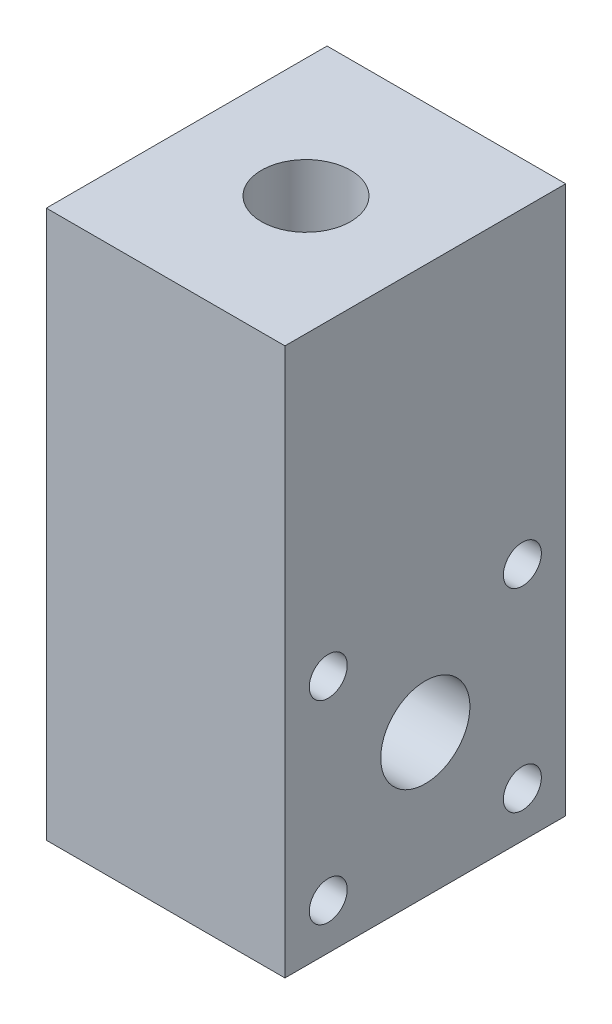
ISO-10303-21;
HEADER;
FILE_DESCRIPTION(('STEP AP214'),'2;1');
FILE_NAME('part.step','',(''),(''),'','','');
FILE_SCHEMA(('AUTOMOTIVE_DESIGN { 1 0 10303 214 1 1 1 1 }'));
ENDSEC;
DATA;
#1=APPLICATION_CONTEXT('core data for automotive mechanical design processes');
#2=APPLICATION_PROTOCOL_DEFINITION('international standard','automotive_design',2000,#1);
#3=PRODUCT_CONTEXT('',#1,'mechanical');
#4=PRODUCT('Part','Part','',(#3));
#5=PRODUCT_RELATED_PRODUCT_CATEGORY('part','',(#4));
#6=PRODUCT_DEFINITION_FORMATION('','',#4);
#7=PRODUCT_DEFINITION_CONTEXT('part definition',#1,'design');
#8=PRODUCT_DEFINITION('design','',#6,#7);
#9=PRODUCT_DEFINITION_SHAPE('','',#8);
#10=(LENGTH_UNIT() NAMED_UNIT(*) SI_UNIT(.MILLI.,.METRE.));
#11=(NAMED_UNIT(*) PLANE_ANGLE_UNIT() SI_UNIT($,.RADIAN.));
#12=(NAMED_UNIT(*) SI_UNIT($,.STERADIAN.) SOLID_ANGLE_UNIT());
#13=UNCERTAINTY_MEASURE_WITH_UNIT(LENGTH_MEASURE(1.E-05),#10,'distance_accuracy_value','');
#14=(GEOMETRIC_REPRESENTATION_CONTEXT(3) GLOBAL_UNCERTAINTY_ASSIGNED_CONTEXT((#13)) GLOBAL_UNIT_ASSIGNED_CONTEXT((#10,
#11,#12)) REPRESENTATION_CONTEXT('',''));
#15=CARTESIAN_POINT('',(0.,0.,0.));
#16=DIRECTION('',(0.,0.,1.));
#17=DIRECTION('',(1.,0.,0.));
#18=AXIS2_PLACEMENT_3D('',#15,#16,#17);
#19=CARTESIAN_POINT('',(8.5,19.5,10.));
#20=DIRECTION('',(-1.,0.,0.));
#21=DIRECTION('',(0.,0.,1.));
#22=AXIS2_PLACEMENT_3D('',#19,#20,#21);
#23=PLANE('',#22);
#24=CARTESIAN_POINT('',(8.5,-2.42520278677676,-6.91479721322324));
#25=DIRECTION('',(1.,0.,0.));
#26=DIRECTION('',(0.,0.,-1.));
#27=AXIS2_PLACEMENT_3D('',#24,#25,#26);
#28=CIRCLE('',#27,1.35254999999999);
#29=CARTESIAN_POINT('',(8.5,-2.42520278677676,-8.26734721322323));
#30=VERTEX_POINT('',#29);
#31=EDGE_CURVE('E135',#30,#30,#28,.T.);
#32=ORIENTED_EDGE('',*,*,#31,.F.);
#33=EDGE_LOOP('',(#32));
#34=FACE_BOUND('',#33,.T.);
#35=CARTESIAN_POINT('',(8.5,-16.2547972132233,6.91479721322324));
#36=DIRECTION('',(1.,0.,0.));
#37=DIRECTION('',(0.,0.,-1.));
#38=AXIS2_PLACEMENT_3D('',#35,#36,#37);
#39=CIRCLE('',#38,1.35254999999999);
#40=CARTESIAN_POINT('',(8.5,-16.2547972132233,5.56224721322325));
#41=VERTEX_POINT('',#40);
#42=EDGE_CURVE('E141',#41,#41,#39,.T.);
#43=ORIENTED_EDGE('',*,*,#42,.F.);
#44=EDGE_LOOP('',(#43));
#45=FACE_BOUND('',#44,.T.);
#46=CARTESIAN_POINT('',(8.5,-16.2547972132233,-6.91479721322319));
#47=DIRECTION('',(1.,0.,0.));
#48=DIRECTION('',(0.,0.,-1.));
#49=AXIS2_PLACEMENT_3D('',#46,#47,#48);
#50=CIRCLE('',#49,1.35254999999999);
#51=CARTESIAN_POINT('',(8.5,-16.2547972132233,-8.26734721322319));
#52=VERTEX_POINT('',#51);
#53=EDGE_CURVE('E142',#52,#52,#50,.T.);
#54=ORIENTED_EDGE('',*,*,#53,.F.);
#55=EDGE_LOOP('',(#54));
#56=FACE_BOUND('',#55,.T.);
#57=CARTESIAN_POINT('',(8.5,-2.42520278677676,6.91479721322324));
#58=DIRECTION('',(1.,0.,0.));
#59=DIRECTION('',(0.,0.,-1.));
#60=AXIS2_PLACEMENT_3D('',#57,#58,#59);
#61=CIRCLE('',#60,1.35254999999999);
#62=CARTESIAN_POINT('',(8.5,-2.42520278677676,5.56224721322324));
#63=VERTEX_POINT('',#62);
#64=EDGE_CURVE('E132',#63,#63,#61,.T.);
#65=ORIENTED_EDGE('',*,*,#64,.F.);
#66=EDGE_LOOP('',(#65));
#67=FACE_BOUND('',#66,.T.);
#68=CARTESIAN_POINT('',(8.5,-9.34,0.));
#69=DIRECTION('',(-1.,0.,0.));
#70=DIRECTION('',(0.,0.,1.));
#71=AXIS2_PLACEMENT_3D('',#68,#69,#70);
#72=CIRCLE('',#71,3.175);
#73=CARTESIAN_POINT('',(8.5,-9.34,3.175));
#74=VERTEX_POINT('',#73);
#75=EDGE_CURVE('E109',#74,#74,#72,.T.);
#76=ORIENTED_EDGE('',*,*,#75,.T.);
#77=EDGE_LOOP('',(#76));
#78=FACE_BOUND('',#77,.T.);
#79=DIRECTION('',(0.,0.,-1.));
#80=VECTOR('',#79,1.);
#81=CARTESIAN_POINT('',(8.5,-19.5,10.));
#82=LINE('',#81,#80);
#83=CARTESIAN_POINT('',(8.5,-19.5,10.));
#84=VERTEX_POINT('',#83);
#85=CARTESIAN_POINT('',(8.5,-19.5,-10.));
#86=VERTEX_POINT('',#85);
#87=EDGE_CURVE('E106',#84,#86,#82,.T.);
#88=ORIENTED_EDGE('',*,*,#87,.T.);
#89=DIRECTION('',(0.,-1.,0.));
#90=VECTOR('',#89,1.);
#91=CARTESIAN_POINT('',(8.5,19.5,-10.));
#92=LINE('',#91,#90);
#93=CARTESIAN_POINT('',(8.5,19.5,-10.));
#94=VERTEX_POINT('',#93);
#95=EDGE_CURVE('E11',#94,#86,#92,.T.);
#96=ORIENTED_EDGE('',*,*,#95,.F.);
#97=DIRECTION('',(0.,0.,-1.));
#98=VECTOR('',#97,1.);
#99=CARTESIAN_POINT('',(8.5,19.5,10.));
#100=LINE('',#99,#98);
#101=CARTESIAN_POINT('',(8.5,19.5,10.));
#102=VERTEX_POINT('',#101);
#103=EDGE_CURVE('E94',#102,#94,#100,.T.);
#104=ORIENTED_EDGE('',*,*,#103,.F.);
#105=DIRECTION('',(0.,-1.,0.));
#106=VECTOR('',#105,1.);
#107=CARTESIAN_POINT('',(8.5,19.5,10.));
#108=LINE('',#107,#106);
#109=EDGE_CURVE('E102',#102,#84,#108,.T.);
#110=ORIENTED_EDGE('',*,*,#109,.T.);
#111=EDGE_LOOP('',(#88,#96,#104,#110));
#112=FACE_BOUND('',#111,.T.);
#113=ADVANCED_FACE('F43',(#34,#45,#56,#67,#78,#112),#23,.F.);
#114=CARTESIAN_POINT('',(-8.5,19.5,-10.));
#115=DIRECTION('',(0.,0.,1.));
#116=DIRECTION('',(1.,0.,0.));
#117=AXIS2_PLACEMENT_3D('',#114,#115,#116);
#118=PLANE('',#117);
#119=DIRECTION('',(-1.,0.,0.));
#120=VECTOR('',#119,1.);
#121=CARTESIAN_POINT('',(-8.5,-19.5,-10.));
#122=LINE('',#121,#120);
#123=CARTESIAN_POINT('',(-8.5,-19.5,-10.));
#124=VERTEX_POINT('',#123);
#125=EDGE_CURVE('E98',#86,#124,#122,.T.);
#126=ORIENTED_EDGE('',*,*,#125,.T.);
#127=DIRECTION('',(0.,-1.,0.));
#128=VECTOR('',#127,1.);
#129=CARTESIAN_POINT('',(-8.5,19.5,-10.));
#130=LINE('',#129,#128);
#131=CARTESIAN_POINT('',(-8.5,19.5,-10.));
#132=VERTEX_POINT('',#131);
#133=EDGE_CURVE('E51',#132,#124,#130,.T.);
#134=ORIENTED_EDGE('',*,*,#133,.F.);
#135=DIRECTION('',(-1.,0.,0.));
#136=VECTOR('',#135,1.);
#137=CARTESIAN_POINT('',(-8.5,19.5,-10.));
#138=LINE('',#137,#136);
#139=EDGE_CURVE('E89',#94,#132,#138,.T.);
#140=ORIENTED_EDGE('',*,*,#139,.F.);
#141=ORIENTED_EDGE('',*,*,#95,.T.);
#142=EDGE_LOOP('',(#126,#134,#140,#141));
#143=FACE_BOUND('',#142,.T.);
#144=ADVANCED_FACE('F97',(#143),#118,.F.);
#145=CARTESIAN_POINT('',(-8.5,19.5,10.));
#146=DIRECTION('',(1.,0.,0.));
#147=DIRECTION('',(0.,0.,-1.));
#148=AXIS2_PLACEMENT_3D('',#145,#146,#147);
#149=PLANE('',#148);
#150=CARTESIAN_POINT('',(-8.5,-2.42520278677676,-6.91479721322324));
#151=DIRECTION('',(1.,0.,0.));
#152=DIRECTION('',(0.,0.,-1.));
#153=AXIS2_PLACEMENT_3D('',#150,#151,#152);
#154=CIRCLE('',#153,1.35254999999999);
#155=CARTESIAN_POINT('',(-8.5,-2.42520278677676,-8.26734721322323));
#156=VERTEX_POINT('',#155);
#157=EDGE_CURVE('E145',#156,#156,#154,.T.);
#158=ORIENTED_EDGE('',*,*,#157,.T.);
#159=EDGE_LOOP('',(#158));
#160=FACE_BOUND('',#159,.T.);
#161=CARTESIAN_POINT('',(-8.5,-16.2547972132233,6.91479721322324));
#162=DIRECTION('',(1.,0.,0.));
#163=DIRECTION('',(0.,0.,-1.));
#164=AXIS2_PLACEMENT_3D('',#161,#162,#163);
#165=CIRCLE('',#164,1.35254999999999);
#166=CARTESIAN_POINT('',(-8.5,-16.2547972132233,5.56224721322325));
#167=VERTEX_POINT('',#166);
#168=EDGE_CURVE('E138',#167,#167,#165,.T.);
#169=ORIENTED_EDGE('',*,*,#168,.T.);
#170=EDGE_LOOP('',(#169));
#171=FACE_BOUND('',#170,.T.);
#172=CARTESIAN_POINT('',(-8.5,-16.2547972132233,-6.91479721322319));
#173=DIRECTION('',(1.,0.,0.));
#174=DIRECTION('',(0.,0.,-1.));
#175=AXIS2_PLACEMENT_3D('',#172,#173,#174);
#176=CIRCLE('',#175,1.35254999999999);
#177=CARTESIAN_POINT('',(-8.5,-16.2547972132233,-8.26734721322319));
#178=VERTEX_POINT('',#177);
#179=EDGE_CURVE('E150',#178,#178,#176,.T.);
#180=ORIENTED_EDGE('',*,*,#179,.T.);
#181=EDGE_LOOP('',(#180));
#182=FACE_BOUND('',#181,.T.);
#183=CARTESIAN_POINT('',(-8.5,-2.42520278677676,6.91479721322324));
#184=DIRECTION('',(1.,0.,0.));
#185=DIRECTION('',(0.,0.,-1.));
#186=AXIS2_PLACEMENT_3D('',#183,#184,#185);
#187=CIRCLE('',#186,1.35254999999999);
#188=CARTESIAN_POINT('',(-8.5,-2.42520278677676,5.56224721322324));
#189=VERTEX_POINT('',#188);
#190=EDGE_CURVE('E129',#189,#189,#187,.T.);
#191=ORIENTED_EDGE('',*,*,#190,.T.);
#192=EDGE_LOOP('',(#191));
#193=FACE_BOUND('',#192,.T.);
#194=CARTESIAN_POINT('',(-8.5,-9.34,0.));
#195=DIRECTION('',(-1.,0.,0.));
#196=DIRECTION('',(0.,0.,1.));
#197=AXIS2_PLACEMENT_3D('',#194,#195,#196);
#198=CIRCLE('',#197,3.175);
#199=CARTESIAN_POINT('',(-8.5,-9.34,3.175));
#200=VERTEX_POINT('',#199);
#201=EDGE_CURVE('E120',#200,#200,#198,.T.);
#202=ORIENTED_EDGE('',*,*,#201,.F.);
#203=EDGE_LOOP('',(#202));
#204=FACE_BOUND('',#203,.T.);
#205=DIRECTION('',(0.,0.,1.));
#206=VECTOR('',#205,1.);
#207=CARTESIAN_POINT('',(-8.5,-19.5,10.));
#208=LINE('',#207,#206);
#209=CARTESIAN_POINT('',(-8.5,-19.5,10.));
#210=VERTEX_POINT('',#209);
#211=EDGE_CURVE('E76',#124,#210,#208,.T.);
#212=ORIENTED_EDGE('',*,*,#211,.T.);
#213=DIRECTION('',(0.,-1.,0.));
#214=VECTOR('',#213,1.);
#215=CARTESIAN_POINT('',(-8.5,19.5,10.));
#216=LINE('',#215,#214);
#217=CARTESIAN_POINT('',(-8.5,19.5,10.));
#218=VERTEX_POINT('',#217);
#219=EDGE_CURVE('E99',#218,#210,#216,.T.);
#220=ORIENTED_EDGE('',*,*,#219,.F.);
#221=DIRECTION('',(0.,0.,1.));
#222=VECTOR('',#221,1.);
#223=CARTESIAN_POINT('',(-8.5,19.5,10.));
#224=LINE('',#223,#222);
#225=EDGE_CURVE('E92',#132,#218,#224,.T.);
#226=ORIENTED_EDGE('',*,*,#225,.F.);
#227=ORIENTED_EDGE('',*,*,#133,.T.);
#228=EDGE_LOOP('',(#212,#220,#226,#227));
#229=FACE_BOUND('',#228,.T.);
#230=ADVANCED_FACE('F100',(#160,#171,#182,#193,#204,#229),#149,.F.);
#231=CARTESIAN_POINT('',(-8.5,19.5,10.));
#232=DIRECTION('',(0.,0.,-1.));
#233=DIRECTION('',(-1.,0.,0.));
#234=AXIS2_PLACEMENT_3D('',#231,#232,#233);
#235=PLANE('',#234);
#236=DIRECTION('',(1.,0.,0.));
#237=VECTOR('',#236,1.);
#238=CARTESIAN_POINT('',(-8.5,-19.5,10.));
#239=LINE('',#238,#237);
#240=EDGE_CURVE('E82',#210,#84,#239,.T.);
#241=ORIENTED_EDGE('',*,*,#240,.T.);
#242=ORIENTED_EDGE('',*,*,#109,.F.);
#243=DIRECTION('',(1.,0.,0.));
#244=VECTOR('',#243,1.);
#245=CARTESIAN_POINT('',(-8.5,19.5,10.));
#246=LINE('',#245,#244);
#247=EDGE_CURVE('E59',#218,#102,#246,.T.);
#248=ORIENTED_EDGE('',*,*,#247,.F.);
#249=ORIENTED_EDGE('',*,*,#219,.T.);
#250=EDGE_LOOP('',(#241,#242,#248,#249));
#251=FACE_BOUND('',#250,.T.);
#252=ADVANCED_FACE('F114',(#251),#235,.F.);
#253=CARTESIAN_POINT('',(0.,19.5,0.));
#254=DIRECTION('',(0.,-1.,0.));
#255=DIRECTION('',(0.,0.,-1.));
#256=AXIS2_PLACEMENT_3D('',#253,#254,#255);
#257=PLANE('',#256);
#258=CARTESIAN_POINT('',(0.,19.5,0.));
#259=DIRECTION('',(0.,1.,0.));
#260=DIRECTION('',(0.,0.,1.));
#261=AXIS2_PLACEMENT_3D('',#258,#259,#260);
#262=CIRCLE('',#261,3.175);
#263=CARTESIAN_POINT('',(0.,19.5,3.175));
#264=VERTEX_POINT('',#263);
#265=EDGE_CURVE('E126',#264,#264,#262,.T.);
#266=ORIENTED_EDGE('',*,*,#265,.F.);
#267=EDGE_LOOP('',(#266));
#268=FACE_BOUND('',#267,.T.);
#269=ORIENTED_EDGE('',*,*,#103,.T.);
#270=ORIENTED_EDGE('',*,*,#139,.T.);
#271=ORIENTED_EDGE('',*,*,#225,.T.);
#272=ORIENTED_EDGE('',*,*,#247,.T.);
#273=EDGE_LOOP('',(#269,#270,#271,#272));
#274=FACE_BOUND('',#273,.T.);
#275=ADVANCED_FACE('F90',(#268,#274),#257,.F.);
#276=CARTESIAN_POINT('',(0.,-19.5,0.));
#277=DIRECTION('',(0.,-1.,0.));
#278=DIRECTION('',(0.,0.,-1.));
#279=AXIS2_PLACEMENT_3D('',#276,#277,#278);
#280=PLANE('',#279);
#281=ORIENTED_EDGE('',*,*,#87,.F.);
#282=ORIENTED_EDGE('',*,*,#240,.F.);
#283=ORIENTED_EDGE('',*,*,#211,.F.);
#284=ORIENTED_EDGE('',*,*,#125,.F.);
#285=EDGE_LOOP('',(#281,#282,#283,#284));
#286=FACE_BOUND('',#285,.T.);
#287=ADVANCED_FACE('F117',(#286),#280,.T.);
#288=CARTESIAN_POINT('',(8.5,-9.34,0.));
#289=DIRECTION('',(-1.,0.,0.));
#290=DIRECTION('',(0.,0.,1.));
#291=AXIS2_PLACEMENT_3D('',#288,#289,#290);
#292=CYLINDRICAL_SURFACE('',#291,3.175);
#293=ORIENTED_EDGE('',*,*,#75,.F.);
#294=EDGE_LOOP('',(#293));
#295=FACE_BOUND('',#294,.T.);
#296=ORIENTED_EDGE('',*,*,#201,.T.);
#297=EDGE_LOOP('',(#296));
#298=FACE_BOUND('',#297,.T.);
#299=ADVANCED_FACE('F165',(#295,#298),#292,.F.);
#300=CARTESIAN_POINT('',(0.,6.8,0.));
#301=DIRECTION('',(0.,1.,0.));
#302=DIRECTION('',(0.,0.,1.));
#303=AXIS2_PLACEMENT_3D('',#300,#301,#302);
#304=CYLINDRICAL_SURFACE('',#303,3.175);
#305=CARTESIAN_POINT('',(0.,6.8,0.));
#306=DIRECTION('',(0.,1.,0.));
#307=DIRECTION('',(0.,0.,1.));
#308=AXIS2_PLACEMENT_3D('',#305,#306,#307);
#309=CIRCLE('',#308,3.175);
#310=CARTESIAN_POINT('',(0.,6.8,3.175));
#311=VERTEX_POINT('',#310);
#312=EDGE_CURVE('E123',#311,#311,#309,.T.);
#313=ORIENTED_EDGE('',*,*,#312,.F.);
#314=EDGE_LOOP('',(#313));
#315=FACE_BOUND('',#314,.T.);
#316=ORIENTED_EDGE('',*,*,#265,.T.);
#317=EDGE_LOOP('',(#316));
#318=FACE_BOUND('',#317,.T.);
#319=ADVANCED_FACE('F168',(#315,#318),#304,.F.);
#320=CARTESIAN_POINT('',(0.,6.8,0.));
#321=DIRECTION('',(0.,1.,0.));
#322=DIRECTION('',(0.,0.,1.));
#323=AXIS2_PLACEMENT_3D('',#320,#321,#322);
#324=PLANE('',#323);
#325=ORIENTED_EDGE('',*,*,#312,.T.);
#326=EDGE_LOOP('',(#325));
#327=FACE_BOUND('',#326,.T.);
#328=ADVANCED_FACE('F190',(#327),#324,.T.);
#329=CARTESIAN_POINT('',(-8.5,-2.42520278677676,6.91479721322324));
#330=DIRECTION('',(1.,0.,0.));
#331=DIRECTION('',(0.,0.,-1.));
#332=AXIS2_PLACEMENT_3D('',#329,#330,#331);
#333=CYLINDRICAL_SURFACE('',#332,1.35254999999999);
#334=ORIENTED_EDGE('',*,*,#190,.F.);
#335=EDGE_LOOP('',(#334));
#336=FACE_BOUND('',#335,.T.);
#337=ORIENTED_EDGE('',*,*,#64,.T.);
#338=EDGE_LOOP('',(#337));
#339=FACE_BOUND('',#338,.T.);
#340=ADVANCED_FACE('F194',(#336,#339),#333,.F.);
#341=CARTESIAN_POINT('',(-8.5,-16.2547972132233,-6.91479721322319));
#342=DIRECTION('',(1.,0.,0.));
#343=DIRECTION('',(0.,0.,-1.));
#344=AXIS2_PLACEMENT_3D('',#341,#342,#343);
#345=CYLINDRICAL_SURFACE('',#344,1.35254999999999);
#346=ORIENTED_EDGE('',*,*,#179,.F.);
#347=EDGE_LOOP('',(#346));
#348=FACE_BOUND('',#347,.T.);
#349=ORIENTED_EDGE('',*,*,#53,.T.);
#350=EDGE_LOOP('',(#349));
#351=FACE_BOUND('',#350,.T.);
#352=ADVANCED_FACE('F156',(#348,#351),#345,.F.);
#353=CARTESIAN_POINT('',(-8.5,-16.2547972132233,6.91479721322324));
#354=DIRECTION('',(1.,0.,0.));
#355=DIRECTION('',(0.,0.,-1.));
#356=AXIS2_PLACEMENT_3D('',#353,#354,#355);
#357=CYLINDRICAL_SURFACE('',#356,1.35254999999999);
#358=ORIENTED_EDGE('',*,*,#168,.F.);
#359=EDGE_LOOP('',(#358));
#360=FACE_BOUND('',#359,.T.);
#361=ORIENTED_EDGE('',*,*,#42,.T.);
#362=EDGE_LOOP('',(#361));
#363=FACE_BOUND('',#362,.T.);
#364=ADVANCED_FACE('F199',(#360,#363),#357,.F.);
#365=CARTESIAN_POINT('',(-8.5,-2.42520278677676,-6.91479721322324));
#366=DIRECTION('',(1.,0.,0.));
#367=DIRECTION('',(0.,0.,-1.));
#368=AXIS2_PLACEMENT_3D('',#365,#366,#367);
#369=CYLINDRICAL_SURFACE('',#368,1.35254999999999);
#370=ORIENTED_EDGE('',*,*,#157,.F.);
#371=EDGE_LOOP('',(#370));
#372=FACE_BOUND('',#371,.T.);
#373=ORIENTED_EDGE('',*,*,#31,.T.);
#374=EDGE_LOOP('',(#373));
#375=FACE_BOUND('',#374,.T.);
#376=ADVANCED_FACE('F202',(#372,#375),#369,.F.);
#377=CLOSED_SHELL('',(#113,#144,#230,#252,#275,#287,#299,#319,#328,#340,#352,#364,#376));
#378=MANIFOLD_SOLID_BREP('B2',#377);
#379=ADVANCED_BREP_SHAPE_REPRESENTATION('',(#18,#378),#14);
#380=SHAPE_DEFINITION_REPRESENTATION(#9,#379);
ENDSEC;
END-ISO-10303-21;
